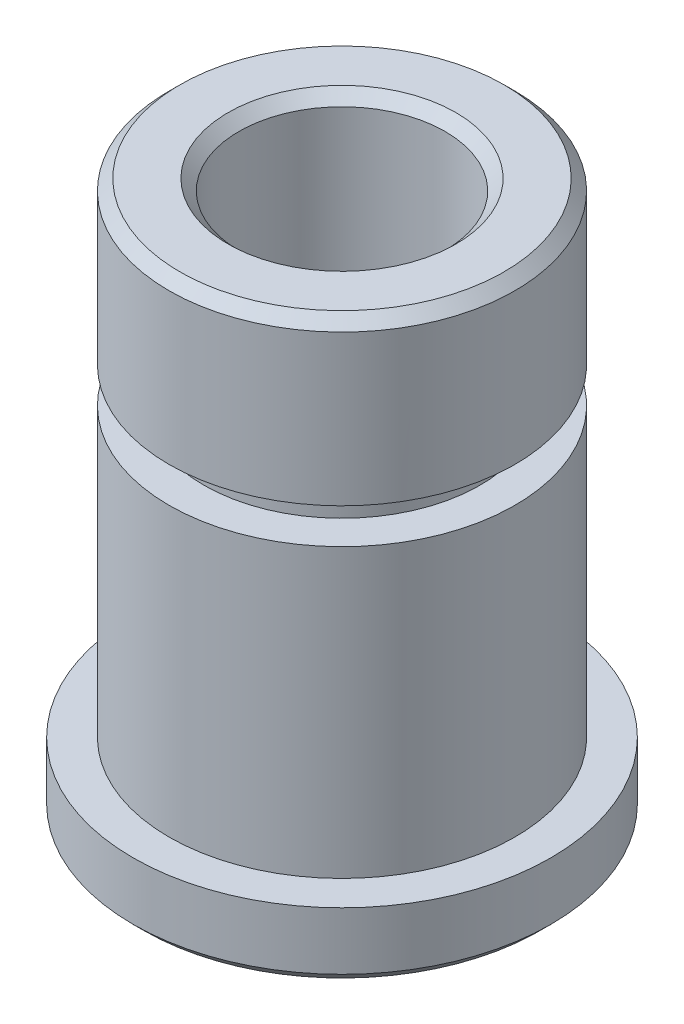
ISO-10303-21;
HEADER;
FILE_DESCRIPTION(('STEP AP214'),'2;1');
FILE_NAME('part.step','',(''),(''),'','','');
FILE_SCHEMA(('AUTOMOTIVE_DESIGN { 1 0 10303 214 1 1 1 1 }'));
ENDSEC;
DATA;
#1=APPLICATION_CONTEXT('core data for automotive mechanical design processes');
#2=APPLICATION_PROTOCOL_DEFINITION('international standard','automotive_design',2000,#1);
#3=PRODUCT_CONTEXT('',#1,'mechanical');
#4=PRODUCT('Part','Part','',(#3));
#5=PRODUCT_RELATED_PRODUCT_CATEGORY('part','',(#4));
#6=PRODUCT_DEFINITION_FORMATION('','',#4);
#7=PRODUCT_DEFINITION_CONTEXT('part definition',#1,'design');
#8=PRODUCT_DEFINITION('design','',#6,#7);
#9=PRODUCT_DEFINITION_SHAPE('','',#8);
#10=(LENGTH_UNIT() NAMED_UNIT(*) SI_UNIT(.MILLI.,.METRE.));
#11=(NAMED_UNIT(*) PLANE_ANGLE_UNIT() SI_UNIT($,.RADIAN.));
#12=(NAMED_UNIT(*) SI_UNIT($,.STERADIAN.) SOLID_ANGLE_UNIT());
#13=UNCERTAINTY_MEASURE_WITH_UNIT(LENGTH_MEASURE(1.E-05),#10,'distance_accuracy_value','');
#14=(GEOMETRIC_REPRESENTATION_CONTEXT(3) GLOBAL_UNCERTAINTY_ASSIGNED_CONTEXT((#13)) GLOBAL_UNIT_ASSIGNED_CONTEXT((#10,
#11,#12)) REPRESENTATION_CONTEXT('',''));
#15=CARTESIAN_POINT('',(0.,0.,0.));
#16=DIRECTION('',(0.,0.,1.));
#17=DIRECTION('',(1.,0.,0.));
#18=AXIS2_PLACEMENT_3D('',#15,#16,#17);
#19=CARTESIAN_POINT('',(0.,-1.35992436178104,0.));
#20=DIRECTION('',(0.,1.,0.));
#21=DIRECTION('',(0.,0.,1.));
#22=AXIS2_PLACEMENT_3D('',#19,#20,#21);
#23=CYLINDRICAL_SURFACE('',#22,2.36855);
#24=CARTESIAN_POINT('',(0.,12.45,0.));
#25=DIRECTION('',(0.,-1.,0.));
#26=DIRECTION('',(0.,0.,-1.));
#27=AXIS2_PLACEMENT_3D('',#24,#25,#26);
#28=CIRCLE('',#27,2.36855);
#29=CARTESIAN_POINT('',(0.,12.45,-2.36855));
#30=VERTEX_POINT('',#29);
#31=EDGE_CURVE('E71',#30,#30,#28,.F.);
#32=ORIENTED_EDGE('',*,*,#31,.T.);
#33=EDGE_LOOP('',(#32));
#34=FACE_BOUND('',#33,.T.);
#35=CARTESIAN_POINT('',(0.,0.249999999999997,0.));
#36=DIRECTION('',(0.,1.,0.));
#37=DIRECTION('',(0.,0.,1.));
#38=AXIS2_PLACEMENT_3D('',#35,#36,#37);
#39=CIRCLE('',#38,2.36855);
#40=CARTESIAN_POINT('',(0.,0.249999999999997,2.36855));
#41=VERTEX_POINT('',#40);
#42=EDGE_CURVE('E74',#41,#41,#39,.F.);
#43=ORIENTED_EDGE('',*,*,#42,.T.);
#44=EDGE_LOOP('',(#43));
#45=FACE_BOUND('',#44,.T.);
#46=ADVANCED_FACE('F45',(#34,#45),#23,.F.);
#47=CARTESIAN_POINT('',(0.,0.,-2.36855));
#48=DIRECTION('',(0.,1.,0.));
#49=DIRECTION('',(0.,0.,1.));
#50=AXIS2_PLACEMENT_3D('',#47,#48,#49);
#51=PLANE('',#50);
#52=CARTESIAN_POINT('',(0.,0.,0.));
#53=DIRECTION('',(0.,1.,0.));
#54=DIRECTION('',(0.,0.,1.));
#55=AXIS2_PLACEMENT_3D('',#52,#53,#54);
#56=CIRCLE('',#55,4.5506);
#57=CARTESIAN_POINT('',(0.,0.,4.5506));
#58=VERTEX_POINT('',#57);
#59=EDGE_CURVE('E52',#58,#58,#56,.F.);
#60=ORIENTED_EDGE('',*,*,#59,.T.);
#61=EDGE_LOOP('',(#60));
#62=FACE_BOUND('',#61,.T.);
#63=CARTESIAN_POINT('',(0.,0.,0.));
#64=DIRECTION('',(0.,1.,0.));
#65=DIRECTION('',(0.,0.,1.));
#66=AXIS2_PLACEMENT_3D('',#63,#64,#65);
#67=CIRCLE('',#66,2.61855);
#68=CARTESIAN_POINT('',(0.,0.,2.61855));
#69=VERTEX_POINT('',#68);
#70=EDGE_CURVE('E56',#69,#69,#67,.T.);
#71=ORIENTED_EDGE('',*,*,#70,.T.);
#72=EDGE_LOOP('',(#71));
#73=FACE_BOUND('',#72,.T.);
#74=ADVANCED_FACE('F130',(#62,#73),#51,.F.);
#75=CARTESIAN_POINT('',(0.,-1.35992436178104,0.));
#76=DIRECTION('',(0.,1.,0.));
#77=DIRECTION('',(0.,0.,1.));
#78=AXIS2_PLACEMENT_3D('',#75,#76,#77);
#79=CYLINDRICAL_SURFACE('',#78,4.8006);
#80=CARTESIAN_POINT('',(0.,0.25,0.));
#81=DIRECTION('',(0.,1.,0.));
#82=DIRECTION('',(0.,0.,1.));
#83=AXIS2_PLACEMENT_3D('',#80,#81,#82);
#84=CIRCLE('',#83,4.8006);
#85=CARTESIAN_POINT('',(0.,0.25,4.8006));
#86=VERTEX_POINT('',#85);
#87=EDGE_CURVE('E60',#86,#86,#84,.T.);
#88=ORIENTED_EDGE('',*,*,#87,.T.);
#89=EDGE_LOOP('',(#88));
#90=FACE_BOUND('',#89,.T.);
#91=CARTESIAN_POINT('',(0.,1.5748,0.));
#92=DIRECTION('',(0.,1.,0.));
#93=DIRECTION('',(0.,0.,1.));
#94=AXIS2_PLACEMENT_3D('',#91,#92,#93);
#95=CIRCLE('',#94,4.8006);
#96=CARTESIAN_POINT('',(0.,1.5748,4.8006));
#97=VERTEX_POINT('',#96);
#98=EDGE_CURVE('E77',#97,#97,#95,.T.);
#99=ORIENTED_EDGE('',*,*,#98,.F.);
#100=EDGE_LOOP('',(#99));
#101=FACE_BOUND('',#100,.T.);
#102=ADVANCED_FACE('F125',(#90,#101),#79,.T.);
#103=CARTESIAN_POINT('',(0.,1.5748,-4.8006));
#104=DIRECTION('',(0.,-1.,0.));
#105=DIRECTION('',(0.,0.,-1.));
#106=AXIS2_PLACEMENT_3D('',#103,#104,#105);
#107=PLANE('',#106);
#108=CARTESIAN_POINT('',(0.,1.5748,0.));
#109=DIRECTION('',(0.,1.,0.));
#110=DIRECTION('',(0.,0.,1.));
#111=AXIS2_PLACEMENT_3D('',#108,#109,#110);
#112=CIRCLE('',#111,3.9751);
#113=CARTESIAN_POINT('',(0.,1.5748,3.9751));
#114=VERTEX_POINT('',#113);
#115=EDGE_CURVE('E80',#114,#114,#112,.T.);
#116=ORIENTED_EDGE('',*,*,#115,.F.);
#117=EDGE_LOOP('',(#116));
#118=FACE_BOUND('',#117,.T.);
#119=ORIENTED_EDGE('',*,*,#98,.T.);
#120=EDGE_LOOP('',(#119));
#121=FACE_BOUND('',#120,.T.);
#122=ADVANCED_FACE('F119',(#118,#121),#107,.F.);
#123=CARTESIAN_POINT('',(0.,-1.35992436178104,0.));
#124=DIRECTION('',(0.,1.,0.));
#125=DIRECTION('',(0.,0.,1.));
#126=AXIS2_PLACEMENT_3D('',#123,#124,#125);
#127=CYLINDRICAL_SURFACE('',#126,3.9751);
#128=CARTESIAN_POINT('',(0.,8.1788,0.));
#129=DIRECTION('',(0.,1.,0.));
#130=DIRECTION('',(0.,0.,1.));
#131=AXIS2_PLACEMENT_3D('',#128,#129,#130);
#132=CIRCLE('',#131,3.9751);
#133=CARTESIAN_POINT('',(0.,8.1788,3.9751));
#134=VERTEX_POINT('',#133);
#135=EDGE_CURVE('E83',#134,#134,#132,.T.);
#136=ORIENTED_EDGE('',*,*,#135,.F.);
#137=EDGE_LOOP('',(#136));
#138=FACE_BOUND('',#137,.T.);
#139=ORIENTED_EDGE('',*,*,#115,.T.);
#140=EDGE_LOOP('',(#139));
#141=FACE_BOUND('',#140,.T.);
#142=ADVANCED_FACE('F113',(#138,#141),#127,.T.);
#143=CARTESIAN_POINT('',(0.,8.1788,-3.9751));
#144=DIRECTION('',(0.,-1.,0.));
#145=DIRECTION('',(0.,0.,-1.));
#146=AXIS2_PLACEMENT_3D('',#143,#144,#145);
#147=PLANE('',#146);
#148=CARTESIAN_POINT('',(0.,8.1788,0.));
#149=DIRECTION('',(0.,1.,0.));
#150=DIRECTION('',(0.,0.,1.));
#151=AXIS2_PLACEMENT_3D('',#148,#149,#150);
#152=CIRCLE('',#151,3.175);
#153=CARTESIAN_POINT('',(0.,8.1788,3.175));
#154=VERTEX_POINT('',#153);
#155=EDGE_CURVE('E86',#154,#154,#152,.T.);
#156=ORIENTED_EDGE('',*,*,#155,.F.);
#157=EDGE_LOOP('',(#156));
#158=FACE_BOUND('',#157,.T.);
#159=ORIENTED_EDGE('',*,*,#135,.T.);
#160=EDGE_LOOP('',(#159));
#161=FACE_BOUND('',#160,.T.);
#162=ADVANCED_FACE('F107',(#158,#161),#147,.F.);
#163=CARTESIAN_POINT('',(0.,-1.35992436178104,0.));
#164=DIRECTION('',(0.,1.,0.));
#165=DIRECTION('',(0.,0.,1.));
#166=AXIS2_PLACEMENT_3D('',#163,#164,#165);
#167=CYLINDRICAL_SURFACE('',#166,3.175);
#168=CARTESIAN_POINT('',(0.,8.9916,0.));
#169=DIRECTION('',(0.,1.,0.));
#170=DIRECTION('',(0.,0.,1.));
#171=AXIS2_PLACEMENT_3D('',#168,#169,#170);
#172=CIRCLE('',#171,3.175);
#173=CARTESIAN_POINT('',(0.,8.9916,3.175));
#174=VERTEX_POINT('',#173);
#175=EDGE_CURVE('E89',#174,#174,#172,.T.);
#176=ORIENTED_EDGE('',*,*,#175,.F.);
#177=EDGE_LOOP('',(#176));
#178=FACE_BOUND('',#177,.T.);
#179=ORIENTED_EDGE('',*,*,#155,.T.);
#180=EDGE_LOOP('',(#179));
#181=FACE_BOUND('',#180,.T.);
#182=ADVANCED_FACE('F101',(#178,#181),#167,.T.);
#183=CARTESIAN_POINT('',(0.,8.9916,-3.9751));
#184=DIRECTION('',(0.,1.,0.));
#185=DIRECTION('',(0.,0.,1.));
#186=AXIS2_PLACEMENT_3D('',#183,#184,#185);
#187=PLANE('',#186);
#188=CARTESIAN_POINT('',(0.,8.9916,0.));
#189=DIRECTION('',(0.,1.,0.));
#190=DIRECTION('',(0.,0.,1.));
#191=AXIS2_PLACEMENT_3D('',#188,#189,#190);
#192=CIRCLE('',#191,3.9751);
#193=CARTESIAN_POINT('',(0.,8.9916,3.9751));
#194=VERTEX_POINT('',#193);
#195=EDGE_CURVE('E92',#194,#194,#192,.T.);
#196=ORIENTED_EDGE('',*,*,#195,.F.);
#197=EDGE_LOOP('',(#196));
#198=FACE_BOUND('',#197,.T.);
#199=ORIENTED_EDGE('',*,*,#175,.T.);
#200=EDGE_LOOP('',(#199));
#201=FACE_BOUND('',#200,.T.);
#202=ADVANCED_FACE('F98',(#198,#201),#187,.F.);
#203=CARTESIAN_POINT('',(0.,-1.35992436178104,0.));
#204=DIRECTION('',(0.,1.,0.));
#205=DIRECTION('',(0.,0.,1.));
#206=AXIS2_PLACEMENT_3D('',#203,#204,#205);
#207=CYLINDRICAL_SURFACE('',#206,3.9751);
#208=CARTESIAN_POINT('',(0.,12.45,0.));
#209=DIRECTION('',(0.,-1.,0.));
#210=DIRECTION('',(0.,0.,-1.));
#211=AXIS2_PLACEMENT_3D('',#208,#209,#210);
#212=CIRCLE('',#211,3.9751);
#213=CARTESIAN_POINT('',(0.,12.45,-3.9751));
#214=VERTEX_POINT('',#213);
#215=EDGE_CURVE('E12',#214,#214,#212,.T.);
#216=ORIENTED_EDGE('',*,*,#215,.T.);
#217=EDGE_LOOP('',(#216));
#218=FACE_BOUND('',#217,.T.);
#219=ORIENTED_EDGE('',*,*,#195,.T.);
#220=EDGE_LOOP('',(#219));
#221=FACE_BOUND('',#220,.T.);
#222=ADVANCED_FACE('F96',(#218,#221),#207,.T.);
#223=CARTESIAN_POINT('',(0.,12.7,-2.36855));
#224=DIRECTION('',(0.,-1.,0.));
#225=DIRECTION('',(0.,0.,-1.));
#226=AXIS2_PLACEMENT_3D('',#223,#224,#225);
#227=PLANE('',#226);
#228=CARTESIAN_POINT('',(0.,12.7,0.));
#229=DIRECTION('',(0.,-1.,0.));
#230=DIRECTION('',(0.,0.,-1.));
#231=AXIS2_PLACEMENT_3D('',#228,#229,#230);
#232=CIRCLE('',#231,2.61855);
#233=CARTESIAN_POINT('',(0.,12.7,-2.61855));
#234=VERTEX_POINT('',#233);
#235=EDGE_CURVE('E65',#234,#234,#232,.T.);
#236=ORIENTED_EDGE('',*,*,#235,.T.);
#237=EDGE_LOOP('',(#236));
#238=FACE_BOUND('',#237,.T.);
#239=CARTESIAN_POINT('',(0.,12.7,0.));
#240=DIRECTION('',(0.,-1.,0.));
#241=DIRECTION('',(0.,0.,-1.));
#242=AXIS2_PLACEMENT_3D('',#239,#240,#241);
#243=CIRCLE('',#242,3.7251);
#244=CARTESIAN_POINT('',(0.,12.7,-3.7251));
#245=VERTEX_POINT('',#244);
#246=EDGE_CURVE('E68',#245,#245,#243,.F.);
#247=ORIENTED_EDGE('',*,*,#246,.T.);
#248=EDGE_LOOP('',(#247));
#249=FACE_BOUND('',#248,.T.);
#250=ADVANCED_FACE('F148',(#238,#249),#227,.F.);
#251=CARTESIAN_POINT('',(0.,12.45,0.));
#252=DIRECTION('',(0.,1.,0.));
#253=DIRECTION('',(0.,0.,1.));
#254=AXIS2_PLACEMENT_3D('',#251,#252,#253);
#255=CONICAL_SURFACE('',#254,2.36855,0.785398163397454);
#256=ORIENTED_EDGE('',*,*,#235,.F.);
#257=EDGE_LOOP('',(#256));
#258=FACE_BOUND('',#257,.T.);
#259=ORIENTED_EDGE('',*,*,#31,.F.);
#260=EDGE_LOOP('',(#259));
#261=FACE_BOUND('',#260,.T.);
#262=ADVANCED_FACE('F144',(#258,#261),#255,.F.);
#263=CARTESIAN_POINT('',(0.,0.25,0.));
#264=DIRECTION('',(0.,1.,0.));
#265=DIRECTION('',(0.,0.,1.));
#266=AXIS2_PLACEMENT_3D('',#263,#264,#265);
#267=CONICAL_SURFACE('',#266,4.8006,0.78539816339745);
#268=ORIENTED_EDGE('',*,*,#59,.F.);
#269=EDGE_LOOP('',(#268));
#270=FACE_BOUND('',#269,.T.);
#271=ORIENTED_EDGE('',*,*,#87,.F.);
#272=EDGE_LOOP('',(#271));
#273=FACE_BOUND('',#272,.T.);
#274=ADVANCED_FACE('F147',(#270,#273),#267,.T.);
#275=CARTESIAN_POINT('',(0.,12.7,0.));
#276=DIRECTION('',(0.,-1.,0.));
#277=DIRECTION('',(0.,0.,-1.));
#278=AXIS2_PLACEMENT_3D('',#275,#276,#277);
#279=CONICAL_SURFACE('',#278,3.7251,0.785398163397448);
#280=ORIENTED_EDGE('',*,*,#215,.F.);
#281=EDGE_LOOP('',(#280));
#282=FACE_BOUND('',#281,.T.);
#283=ORIENTED_EDGE('',*,*,#246,.F.);
#284=EDGE_LOOP('',(#283));
#285=FACE_BOUND('',#284,.T.);
#286=ADVANCED_FACE('F151',(#282,#285),#279,.T.);
#287=CARTESIAN_POINT('',(0.,0.,0.));
#288=DIRECTION('',(0.,-1.,0.));
#289=DIRECTION('',(0.,0.,-1.));
#290=AXIS2_PLACEMENT_3D('',#287,#288,#289);
#291=CONICAL_SURFACE('',#290,2.61855,0.785398163397451);
#292=ORIENTED_EDGE('',*,*,#42,.F.);
#293=EDGE_LOOP('',(#292));
#294=FACE_BOUND('',#293,.T.);
#295=ORIENTED_EDGE('',*,*,#70,.F.);
#296=EDGE_LOOP('',(#295));
#297=FACE_BOUND('',#296,.T.);
#298=ADVANCED_FACE('F47',(#294,#297),#291,.F.);
#299=CLOSED_SHELL('',(#46,#74,#102,#122,#142,#162,#182,#202,#222,#250,#262,#274,#286,#298));
#300=MANIFOLD_SOLID_BREP('B2',#299);
#301=ADVANCED_BREP_SHAPE_REPRESENTATION('',(#18,#300),#14);
#302=SHAPE_DEFINITION_REPRESENTATION(#9,#301);
ENDSEC;
END-ISO-10303-21;
